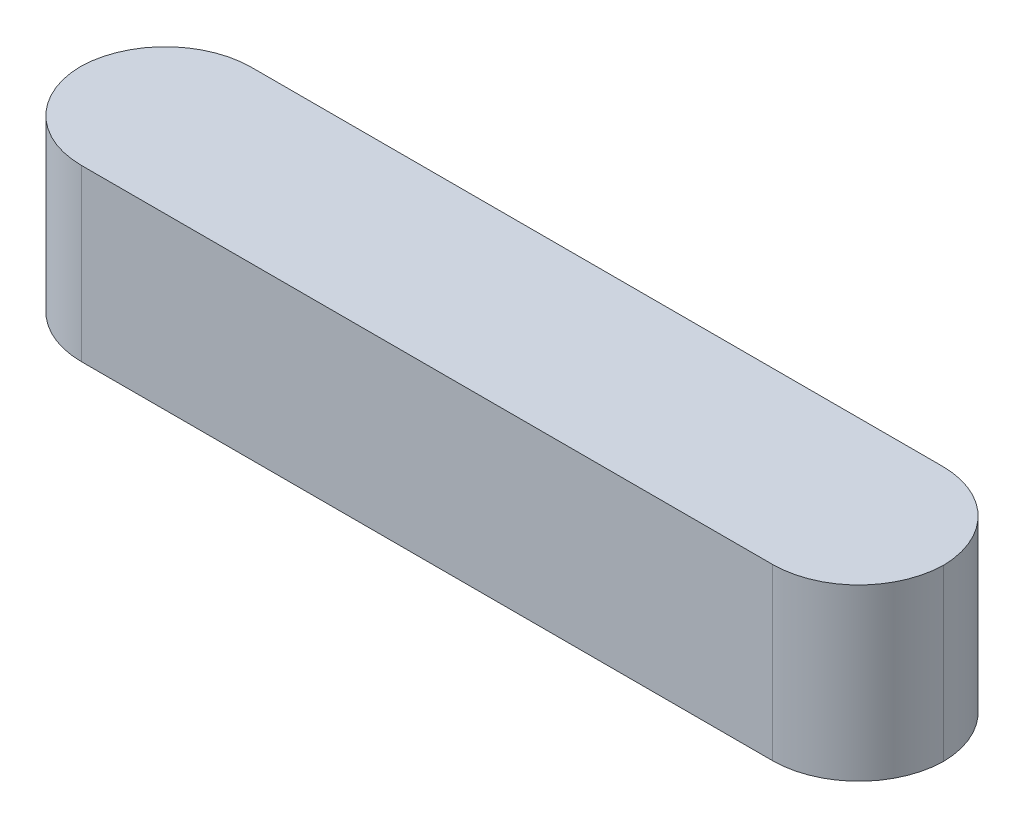
ISO-10303-21;
HEADER;
FILE_DESCRIPTION(('STEP AP214'),'2;1');
FILE_NAME('part.step','',(''),(''),'','','');
FILE_SCHEMA(('AUTOMOTIVE_DESIGN { 1 0 10303 214 1 1 1 1 }'));
ENDSEC;
DATA;
#1=APPLICATION_CONTEXT('core data for automotive mechanical design processes');
#2=APPLICATION_PROTOCOL_DEFINITION('international standard','automotive_design',2000,#1);
#3=PRODUCT_CONTEXT('',#1,'mechanical');
#4=PRODUCT('Part','Part','',(#3));
#5=PRODUCT_RELATED_PRODUCT_CATEGORY('part','',(#4));
#6=PRODUCT_DEFINITION_FORMATION('','',#4);
#7=PRODUCT_DEFINITION_CONTEXT('part definition',#1,'design');
#8=PRODUCT_DEFINITION('design','',#6,#7);
#9=PRODUCT_DEFINITION_SHAPE('','',#8);
#10=(LENGTH_UNIT() NAMED_UNIT(*) SI_UNIT(.MILLI.,.METRE.));
#11=(NAMED_UNIT(*) PLANE_ANGLE_UNIT() SI_UNIT($,.RADIAN.));
#12=(NAMED_UNIT(*) SI_UNIT($,.STERADIAN.) SOLID_ANGLE_UNIT());
#13=UNCERTAINTY_MEASURE_WITH_UNIT(LENGTH_MEASURE(1.E-05),#10,'distance_accuracy_value','');
#14=(GEOMETRIC_REPRESENTATION_CONTEXT(3) GLOBAL_UNCERTAINTY_ASSIGNED_CONTEXT((#13)) GLOBAL_UNIT_ASSIGNED_CONTEXT((#10,
#11,#12)) REPRESENTATION_CONTEXT('',''));
#15=CARTESIAN_POINT('',(0.,0.,0.));
#16=DIRECTION('',(0.,0.,1.));
#17=DIRECTION('',(1.,0.,0.));
#18=AXIS2_PLACEMENT_3D('',#15,#16,#17);
#19=CARTESIAN_POINT('',(0.,5.,5.));
#20=DIRECTION('',(0.,0.,-1.));
#21=DIRECTION('',(-1.,0.,0.));
#22=AXIS2_PLACEMENT_3D('',#19,#20,#21);
#23=PLANE('',#22);
#24=DIRECTION('',(1.,0.,0.));
#25=VECTOR('',#24,1.);
#26=CARTESIAN_POINT('',(0.,5.,5.));
#27=LINE('',#26,#25);
#28=CARTESIAN_POINT('',(2.54,5.,5.));
#29=VERTEX_POINT('',#28);
#30=CARTESIAN_POINT('',(22.86,5.,5.));
#31=VERTEX_POINT('',#30);
#32=EDGE_CURVE('E108',#29,#31,#27,.T.);
#33=ORIENTED_EDGE('',*,*,#32,.F.);
#34=DIRECTION('',(0.,-1.,0.));
#35=VECTOR('',#34,1.);
#36=CARTESIAN_POINT('',(2.54,5.,5.));
#37=LINE('',#36,#35);
#38=CARTESIAN_POINT('',(2.54,0.,5.));
#39=VERTEX_POINT('',#38);
#40=EDGE_CURVE('E96',#29,#39,#37,.T.);
#41=ORIENTED_EDGE('',*,*,#40,.T.);
#42=DIRECTION('',(1.,0.,0.));
#43=VECTOR('',#42,1.);
#44=CARTESIAN_POINT('',(0.,0.,5.));
#45=LINE('',#44,#43);
#46=CARTESIAN_POINT('',(22.86,0.,5.));
#47=VERTEX_POINT('',#46);
#48=EDGE_CURVE('E106',#39,#47,#45,.T.);
#49=ORIENTED_EDGE('',*,*,#48,.T.);
#50=DIRECTION('',(0.,-1.,0.));
#51=VECTOR('',#50,1.);
#52=CARTESIAN_POINT('',(22.86,5.,5.));
#53=LINE('',#52,#51);
#54=EDGE_CURVE('E110',#47,#31,#53,.F.);
#55=ORIENTED_EDGE('',*,*,#54,.T.);
#56=EDGE_LOOP('',(#33,#41,#49,#55));
#57=FACE_BOUND('',#56,.T.);
#58=ADVANCED_FACE('F37',(#57),#23,.F.);
#59=CARTESIAN_POINT('',(0.,5.,0.));
#60=DIRECTION('',(0.,0.,1.));
#61=DIRECTION('',(1.,0.,0.));
#62=AXIS2_PLACEMENT_3D('',#59,#60,#61);
#63=PLANE('',#62);
#64=DIRECTION('',(-1.,0.,0.));
#65=VECTOR('',#64,1.);
#66=CARTESIAN_POINT('',(0.,0.,0.));
#67=LINE('',#66,#65);
#68=CARTESIAN_POINT('',(22.86,0.,0.));
#69=VERTEX_POINT('',#68);
#70=CARTESIAN_POINT('',(2.54,0.,0.));
#71=VERTEX_POINT('',#70);
#72=EDGE_CURVE('E114',#69,#71,#67,.T.);
#73=ORIENTED_EDGE('',*,*,#72,.T.);
#74=DIRECTION('',(0.,-1.,0.));
#75=VECTOR('',#74,1.);
#76=CARTESIAN_POINT('',(2.54,5.,0.));
#77=LINE('',#76,#75);
#78=CARTESIAN_POINT('',(2.54,5.,0.));
#79=VERTEX_POINT('',#78);
#80=EDGE_CURVE('E11',#71,#79,#77,.F.);
#81=ORIENTED_EDGE('',*,*,#80,.T.);
#82=DIRECTION('',(-1.,0.,0.));
#83=VECTOR('',#82,1.);
#84=CARTESIAN_POINT('',(0.,5.,0.));
#85=LINE('',#84,#83);
#86=CARTESIAN_POINT('',(22.86,5.,0.));
#87=VERTEX_POINT('',#86);
#88=EDGE_CURVE('E119',#87,#79,#85,.T.);
#89=ORIENTED_EDGE('',*,*,#88,.F.);
#90=DIRECTION('',(0.,-1.,0.));
#91=VECTOR('',#90,1.);
#92=CARTESIAN_POINT('',(22.86,5.,0.));
#93=LINE('',#92,#91);
#94=EDGE_CURVE('E46',#87,#69,#93,.T.);
#95=ORIENTED_EDGE('',*,*,#94,.T.);
#96=EDGE_LOOP('',(#73,#81,#89,#95));
#97=FACE_BOUND('',#96,.T.);
#98=ADVANCED_FACE('F138',(#97),#63,.F.);
#99=CARTESIAN_POINT('',(0.,5.,0.));
#100=DIRECTION('',(0.,1.,0.));
#101=DIRECTION('',(0.,0.,1.));
#102=AXIS2_PLACEMENT_3D('',#99,#100,#101);
#103=PLANE('',#102);
#104=CARTESIAN_POINT('',(2.54,5.,2.54));
#105=DIRECTION('',(0.,1.,0.));
#106=DIRECTION('',(0.,0.,1.));
#107=AXIS2_PLACEMENT_3D('',#104,#105,#106);
#108=CIRCLE('',#107,2.54);
#109=CARTESIAN_POINT('',(0.000314980159941882,5.,2.5));
#110=VERTEX_POINT('',#109);
#111=EDGE_CURVE('E54',#79,#110,#108,.T.);
#112=ORIENTED_EDGE('',*,*,#111,.T.);
#113=CARTESIAN_POINT('',(2.54,5.,2.46));
#114=DIRECTION('',(0.,1.,0.));
#115=DIRECTION('',(0.,0.,1.));
#116=AXIS2_PLACEMENT_3D('',#113,#114,#115);
#117=CIRCLE('',#116,2.54);
#118=EDGE_CURVE('E131',#110,#29,#117,.T.);
#119=ORIENTED_EDGE('',*,*,#118,.T.);
#120=ORIENTED_EDGE('',*,*,#32,.T.);
#121=CARTESIAN_POINT('',(22.86,5.,2.46));
#122=DIRECTION('',(0.,1.,0.));
#123=DIRECTION('',(0.,0.,1.));
#124=AXIS2_PLACEMENT_3D('',#121,#122,#123);
#125=CIRCLE('',#124,2.54);
#126=CARTESIAN_POINT('',(25.3996850198401,5.,2.5));
#127=VERTEX_POINT('',#126);
#128=EDGE_CURVE('E61',#31,#127,#125,.T.);
#129=ORIENTED_EDGE('',*,*,#128,.T.);
#130=CARTESIAN_POINT('',(22.86,5.,2.54));
#131=DIRECTION('',(0.,1.,0.));
#132=DIRECTION('',(0.,0.,1.));
#133=AXIS2_PLACEMENT_3D('',#130,#131,#132);
#134=CIRCLE('',#133,2.54);
#135=EDGE_CURVE('E128',#127,#87,#134,.T.);
#136=ORIENTED_EDGE('',*,*,#135,.T.);
#137=ORIENTED_EDGE('',*,*,#88,.T.);
#138=EDGE_LOOP('',(#112,#119,#120,#129,#136,#137));
#139=FACE_BOUND('',#138,.T.);
#140=ADVANCED_FACE('F144',(#139),#103,.T.);
#141=CARTESIAN_POINT('',(0.,0.,0.));
#142=DIRECTION('',(0.,1.,0.));
#143=DIRECTION('',(0.,0.,1.));
#144=AXIS2_PLACEMENT_3D('',#141,#142,#143);
#145=PLANE('',#144);
#146=ORIENTED_EDGE('',*,*,#48,.F.);
#147=CARTESIAN_POINT('',(2.54,0.,2.46));
#148=DIRECTION('',(0.,1.,0.));
#149=DIRECTION('',(0.,0.,1.));
#150=AXIS2_PLACEMENT_3D('',#147,#148,#149);
#151=CIRCLE('',#150,2.54);
#152=CARTESIAN_POINT('',(0.000314980159941882,0.,2.5));
#153=VERTEX_POINT('',#152);
#154=EDGE_CURVE('E92',#39,#153,#151,.F.);
#155=ORIENTED_EDGE('',*,*,#154,.T.);
#156=CARTESIAN_POINT('',(2.54,0.,2.54));
#157=DIRECTION('',(0.,1.,0.));
#158=DIRECTION('',(0.,0.,1.));
#159=AXIS2_PLACEMENT_3D('',#156,#157,#158);
#160=CIRCLE('',#159,2.54);
#161=EDGE_CURVE('E101',#153,#71,#160,.F.);
#162=ORIENTED_EDGE('',*,*,#161,.T.);
#163=ORIENTED_EDGE('',*,*,#72,.F.);
#164=CARTESIAN_POINT('',(22.86,0.,2.54));
#165=DIRECTION('',(0.,1.,0.));
#166=DIRECTION('',(0.,0.,1.));
#167=AXIS2_PLACEMENT_3D('',#164,#165,#166);
#168=CIRCLE('',#167,2.54);
#169=CARTESIAN_POINT('',(25.3996850198401,0.,2.5));
#170=VERTEX_POINT('',#169);
#171=EDGE_CURVE('E124',#69,#170,#168,.F.);
#172=ORIENTED_EDGE('',*,*,#171,.T.);
#173=CARTESIAN_POINT('',(22.86,0.,2.46));
#174=DIRECTION('',(0.,1.,0.));
#175=DIRECTION('',(0.,0.,1.));
#176=AXIS2_PLACEMENT_3D('',#173,#174,#175);
#177=CIRCLE('',#176,2.54);
#178=EDGE_CURVE('E109',#170,#47,#177,.F.);
#179=ORIENTED_EDGE('',*,*,#178,.T.);
#180=EDGE_LOOP('',(#146,#155,#162,#163,#172,#179));
#181=FACE_BOUND('',#180,.T.);
#182=ADVANCED_FACE('F112',(#181),#145,.F.);
#183=CARTESIAN_POINT('',(2.54,5.,2.54));
#184=DIRECTION('',(0.,-1.,0.));
#185=DIRECTION('',(0.,0.,-1.));
#186=AXIS2_PLACEMENT_3D('',#183,#184,#185);
#187=CYLINDRICAL_SURFACE('',#186,2.54);
#188=DIRECTION('',(0.,-1.,0.));
#189=VECTOR('',#188,1.);
#190=CARTESIAN_POINT('',(0.000314980159941448,2.5,2.5));
#191=LINE('',#190,#189);
#192=EDGE_CURVE('E97',#110,#153,#191,.T.);
#193=ORIENTED_EDGE('',*,*,#192,.F.);
#194=ORIENTED_EDGE('',*,*,#111,.F.);
#195=ORIENTED_EDGE('',*,*,#80,.F.);
#196=ORIENTED_EDGE('',*,*,#161,.F.);
#197=EDGE_LOOP('',(#193,#194,#195,#196));
#198=FACE_BOUND('',#197,.T.);
#199=ADVANCED_FACE('F143',(#198),#187,.T.);
#200=CARTESIAN_POINT('',(2.54,5.,2.46));
#201=DIRECTION('',(0.,-1.,0.));
#202=DIRECTION('',(0.,0.,-1.));
#203=AXIS2_PLACEMENT_3D('',#200,#201,#202);
#204=CYLINDRICAL_SURFACE('',#203,2.54);
#205=ORIENTED_EDGE('',*,*,#118,.F.);
#206=ORIENTED_EDGE('',*,*,#192,.T.);
#207=ORIENTED_EDGE('',*,*,#154,.F.);
#208=ORIENTED_EDGE('',*,*,#40,.F.);
#209=EDGE_LOOP('',(#205,#206,#207,#208));
#210=FACE_BOUND('',#209,.T.);
#211=ADVANCED_FACE('F95',(#210),#204,.T.);
#212=CARTESIAN_POINT('',(22.86,5.,2.46));
#213=DIRECTION('',(0.,-1.,0.));
#214=DIRECTION('',(0.,0.,-1.));
#215=AXIS2_PLACEMENT_3D('',#212,#213,#214);
#216=CYLINDRICAL_SURFACE('',#215,2.54);
#217=DIRECTION('',(0.,-1.,0.));
#218=VECTOR('',#217,1.);
#219=CARTESIAN_POINT('',(25.3996850198401,2.5,2.5));
#220=LINE('',#219,#218);
#221=EDGE_CURVE('E41',#127,#170,#220,.T.);
#222=ORIENTED_EDGE('',*,*,#221,.F.);
#223=ORIENTED_EDGE('',*,*,#128,.F.);
#224=ORIENTED_EDGE('',*,*,#54,.F.);
#225=ORIENTED_EDGE('',*,*,#178,.F.);
#226=EDGE_LOOP('',(#222,#223,#224,#225));
#227=FACE_BOUND('',#226,.T.);
#228=ADVANCED_FACE('F39',(#227),#216,.T.);
#229=CARTESIAN_POINT('',(22.86,5.,2.54));
#230=DIRECTION('',(0.,-1.,0.));
#231=DIRECTION('',(0.,0.,-1.));
#232=AXIS2_PLACEMENT_3D('',#229,#230,#231);
#233=CYLINDRICAL_SURFACE('',#232,2.54);
#234=ORIENTED_EDGE('',*,*,#135,.F.);
#235=ORIENTED_EDGE('',*,*,#221,.T.);
#236=ORIENTED_EDGE('',*,*,#171,.F.);
#237=ORIENTED_EDGE('',*,*,#94,.F.);
#238=EDGE_LOOP('',(#234,#235,#236,#237));
#239=FACE_BOUND('',#238,.T.);
#240=ADVANCED_FACE('F147',(#239),#233,.T.);
#241=CLOSED_SHELL('',(#58,#98,#140,#182,#199,#211,#228,#240));
#242=MANIFOLD_SOLID_BREP('B2',#241);
#243=ADVANCED_BREP_SHAPE_REPRESENTATION('',(#18,#242),#14);
#244=SHAPE_DEFINITION_REPRESENTATION(#9,#243);
ENDSEC;
END-ISO-10303-21;
